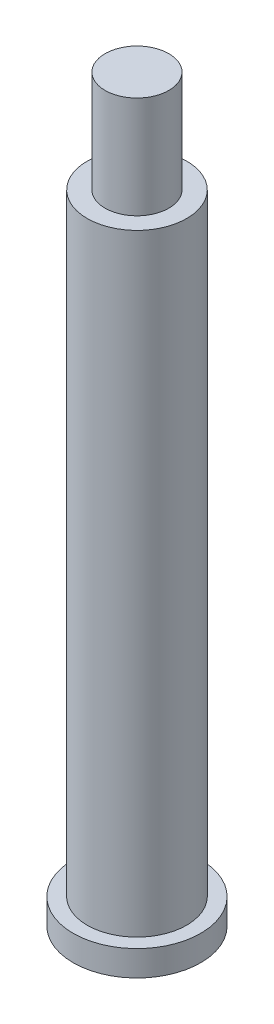
ISO-10303-21;
HEADER;
FILE_DESCRIPTION(('STEP AP214'),'2;1');
FILE_NAME('part.step','',(''),(''),'','','');
FILE_SCHEMA(('AUTOMOTIVE_DESIGN { 1 0 10303 214 1 1 1 1 }'));
ENDSEC;
DATA;
#1=APPLICATION_CONTEXT('core data for automotive mechanical design processes');
#2=APPLICATION_PROTOCOL_DEFINITION('international standard','automotive_design',2000,#1);
#3=PRODUCT_CONTEXT('',#1,'mechanical');
#4=PRODUCT('Part','Part','',(#3));
#5=PRODUCT_RELATED_PRODUCT_CATEGORY('part','',(#4));
#6=PRODUCT_DEFINITION_FORMATION('','',#4);
#7=PRODUCT_DEFINITION_CONTEXT('part definition',#1,'design');
#8=PRODUCT_DEFINITION('design','',#6,#7);
#9=PRODUCT_DEFINITION_SHAPE('','',#8);
#10=(LENGTH_UNIT() NAMED_UNIT(*) SI_UNIT(.MILLI.,.METRE.));
#11=(NAMED_UNIT(*) PLANE_ANGLE_UNIT() SI_UNIT($,.RADIAN.));
#12=(NAMED_UNIT(*) SI_UNIT($,.STERADIAN.) SOLID_ANGLE_UNIT());
#13=UNCERTAINTY_MEASURE_WITH_UNIT(LENGTH_MEASURE(1.E-05),#10,'distance_accuracy_value','');
#14=(GEOMETRIC_REPRESENTATION_CONTEXT(3) GLOBAL_UNCERTAINTY_ASSIGNED_CONTEXT((#13)) GLOBAL_UNIT_ASSIGNED_CONTEXT((#10,
#11,#12)) REPRESENTATION_CONTEXT('',''));
#15=CARTESIAN_POINT('',(0.,0.,0.));
#16=DIRECTION('',(0.,0.,1.));
#17=DIRECTION('',(1.,0.,0.));
#18=AXIS2_PLACEMENT_3D('',#15,#16,#17);
#19=CARTESIAN_POINT('',(0.,2.,0.));
#20=DIRECTION('',(0.,-1.,0.));
#21=DIRECTION('',(0.,0.,-1.));
#22=AXIS2_PLACEMENT_3D('',#19,#20,#21);
#23=CYLINDRICAL_SURFACE('',#22,5.);
#24=CARTESIAN_POINT('',(0.,2.,0.));
#25=DIRECTION('',(0.,1.,0.));
#26=DIRECTION('',(0.,0.,1.));
#27=AXIS2_PLACEMENT_3D('',#24,#25,#26);
#28=CIRCLE('',#27,5.);
#29=CARTESIAN_POINT('',(0.,2.,5.));
#30=VERTEX_POINT('',#29);
#31=EDGE_CURVE('E51',#30,#30,#28,.T.);
#32=ORIENTED_EDGE('',*,*,#31,.F.);
#33=EDGE_LOOP('',(#32));
#34=FACE_BOUND('',#33,.T.);
#35=CARTESIAN_POINT('',(0.,0.,0.));
#36=DIRECTION('',(0.,1.,0.));
#37=DIRECTION('',(0.,0.,1.));
#38=AXIS2_PLACEMENT_3D('',#35,#36,#37);
#39=CIRCLE('',#38,5.);
#40=CARTESIAN_POINT('',(0.,0.,5.));
#41=VERTEX_POINT('',#40);
#42=EDGE_CURVE('E40',#41,#41,#39,.T.);
#43=ORIENTED_EDGE('',*,*,#42,.T.);
#44=EDGE_LOOP('',(#43));
#45=FACE_BOUND('',#44,.T.);
#46=ADVANCED_FACE('F37',(#34,#45),#23,.T.);
#47=CARTESIAN_POINT('',(0.,2.,0.));
#48=DIRECTION('',(0.,1.,0.));
#49=DIRECTION('',(0.,0.,1.));
#50=AXIS2_PLACEMENT_3D('',#47,#48,#49);
#51=PLANE('',#50);
#52=CARTESIAN_POINT('',(0.,2.,0.));
#53=DIRECTION('',(0.,1.,0.));
#54=DIRECTION('',(0.,0.,1.));
#55=AXIS2_PLACEMENT_3D('',#52,#53,#54);
#56=CIRCLE('',#55,3.9);
#57=CARTESIAN_POINT('',(0.,2.,3.9));
#58=VERTEX_POINT('',#57);
#59=EDGE_CURVE('E45',#58,#58,#56,.T.);
#60=ORIENTED_EDGE('',*,*,#59,.F.);
#61=EDGE_LOOP('',(#60));
#62=FACE_BOUND('',#61,.T.);
#63=ORIENTED_EDGE('',*,*,#31,.T.);
#64=EDGE_LOOP('',(#63));
#65=FACE_BOUND('',#64,.T.);
#66=ADVANCED_FACE('F71',(#62,#65),#51,.T.);
#67=CARTESIAN_POINT('',(0.,0.,0.));
#68=DIRECTION('',(0.,1.,0.));
#69=DIRECTION('',(0.,0.,1.));
#70=AXIS2_PLACEMENT_3D('',#67,#68,#69);
#71=PLANE('',#70);
#72=ORIENTED_EDGE('',*,*,#42,.F.);
#73=EDGE_LOOP('',(#72));
#74=FACE_BOUND('',#73,.T.);
#75=ADVANCED_FACE('F68',(#74),#71,.F.);
#76=CARTESIAN_POINT('',(0.,50.,0.));
#77=DIRECTION('',(0.,-1.,0.));
#78=DIRECTION('',(0.,0.,-1.));
#79=AXIS2_PLACEMENT_3D('',#76,#77,#78);
#80=CYLINDRICAL_SURFACE('',#79,3.9);
#81=CARTESIAN_POINT('',(0.,50.,0.));
#82=DIRECTION('',(0.,1.,0.));
#83=DIRECTION('',(0.,0.,1.));
#84=AXIS2_PLACEMENT_3D('',#81,#82,#83);
#85=CIRCLE('',#84,3.9);
#86=CARTESIAN_POINT('',(0.,50.,3.9));
#87=VERTEX_POINT('',#86);
#88=EDGE_CURVE('E56',#87,#87,#85,.T.);
#89=ORIENTED_EDGE('',*,*,#88,.F.);
#90=EDGE_LOOP('',(#89));
#91=FACE_BOUND('',#90,.T.);
#92=ORIENTED_EDGE('',*,*,#59,.T.);
#93=EDGE_LOOP('',(#92));
#94=FACE_BOUND('',#93,.T.);
#95=ADVANCED_FACE('F70',(#91,#94),#80,.T.);
#96=CARTESIAN_POINT('',(0.,50.,0.));
#97=DIRECTION('',(0.,1.,0.));
#98=DIRECTION('',(0.,0.,1.));
#99=AXIS2_PLACEMENT_3D('',#96,#97,#98);
#100=PLANE('',#99);
#101=CARTESIAN_POINT('',(0.,50.,0.));
#102=DIRECTION('',(0.,1.,0.));
#103=DIRECTION('',(0.,0.,1.));
#104=AXIS2_PLACEMENT_3D('',#101,#102,#103);
#105=CIRCLE('',#104,2.5);
#106=CARTESIAN_POINT('',(0.,50.,2.5));
#107=VERTEX_POINT('',#106);
#108=EDGE_CURVE('E10',#107,#107,#105,.T.);
#109=ORIENTED_EDGE('',*,*,#108,.F.);
#110=EDGE_LOOP('',(#109));
#111=FACE_BOUND('',#110,.T.);
#112=ORIENTED_EDGE('',*,*,#88,.T.);
#113=EDGE_LOOP('',(#112));
#114=FACE_BOUND('',#113,.T.);
#115=ADVANCED_FACE('F76',(#111,#114),#100,.T.);
#116=CARTESIAN_POINT('',(0.,58.,0.));
#117=DIRECTION('',(0.,-1.,0.));
#118=DIRECTION('',(0.,0.,-1.));
#119=AXIS2_PLACEMENT_3D('',#116,#117,#118);
#120=CYLINDRICAL_SURFACE('',#119,2.5);
#121=CARTESIAN_POINT('',(0.,58.,0.));
#122=DIRECTION('',(0.,1.,0.));
#123=DIRECTION('',(0.,0.,1.));
#124=AXIS2_PLACEMENT_3D('',#121,#122,#123);
#125=CIRCLE('',#124,2.5);
#126=CARTESIAN_POINT('',(0.,58.,2.5));
#127=VERTEX_POINT('',#126);
#128=EDGE_CURVE('E55',#127,#127,#125,.T.);
#129=ORIENTED_EDGE('',*,*,#128,.F.);
#130=EDGE_LOOP('',(#129));
#131=FACE_BOUND('',#130,.T.);
#132=ORIENTED_EDGE('',*,*,#108,.T.);
#133=EDGE_LOOP('',(#132));
#134=FACE_BOUND('',#133,.T.);
#135=ADVANCED_FACE('F106',(#131,#134),#120,.T.);
#136=CARTESIAN_POINT('',(0.,58.,0.));
#137=DIRECTION('',(0.,1.,0.));
#138=DIRECTION('',(0.,0.,1.));
#139=AXIS2_PLACEMENT_3D('',#136,#137,#138);
#140=PLANE('',#139);
#141=ORIENTED_EDGE('',*,*,#128,.T.);
#142=EDGE_LOOP('',(#141));
#143=FACE_BOUND('',#142,.T.);
#144=ADVANCED_FACE('F116',(#143),#140,.T.);
#145=CLOSED_SHELL('',(#46,#66,#75,#95,#115,#135,#144));
#146=MANIFOLD_SOLID_BREP('B2',#145);
#147=ADVANCED_BREP_SHAPE_REPRESENTATION('',(#18,#146),#14);
#148=SHAPE_DEFINITION_REPRESENTATION(#9,#147);
ENDSEC;
END-ISO-10303-21;
